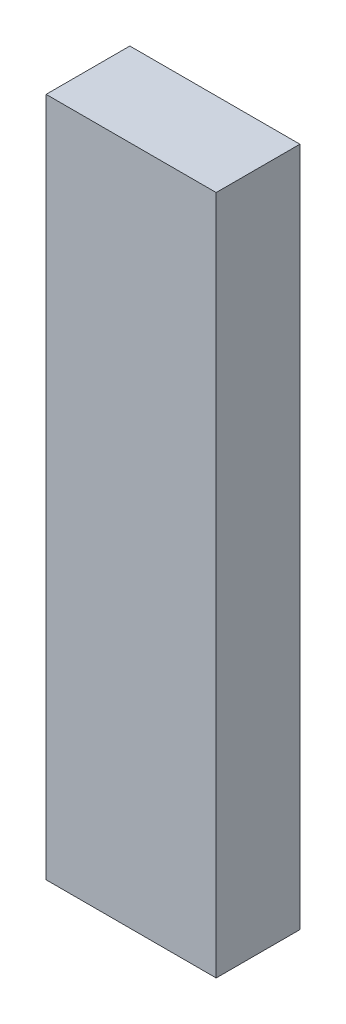
ISO-10303-21;
HEADER;
FILE_DESCRIPTION(('STEP AP214'),'2;1');
FILE_NAME('part.step','',(''),(''),'','','');
FILE_SCHEMA(('AUTOMOTIVE_DESIGN { 1 0 10303 214 1 1 1 1 }'));
ENDSEC;
DATA;
#1=APPLICATION_CONTEXT('core data for automotive mechanical design processes');
#2=APPLICATION_PROTOCOL_DEFINITION('international standard','automotive_design',2000,#1);
#3=PRODUCT_CONTEXT('',#1,'mechanical');
#4=PRODUCT('Part','Part','',(#3));
#5=PRODUCT_RELATED_PRODUCT_CATEGORY('part','',(#4));
#6=PRODUCT_DEFINITION_FORMATION('','',#4);
#7=PRODUCT_DEFINITION_CONTEXT('part definition',#1,'design');
#8=PRODUCT_DEFINITION('design','',#6,#7);
#9=PRODUCT_DEFINITION_SHAPE('','',#8);
#10=(LENGTH_UNIT() NAMED_UNIT(*) SI_UNIT(.MILLI.,.METRE.));
#11=(NAMED_UNIT(*) PLANE_ANGLE_UNIT() SI_UNIT($,.RADIAN.));
#12=(NAMED_UNIT(*) SI_UNIT($,.STERADIAN.) SOLID_ANGLE_UNIT());
#13=UNCERTAINTY_MEASURE_WITH_UNIT(LENGTH_MEASURE(1.E-05),#10,'distance_accuracy_value','');
#14=(GEOMETRIC_REPRESENTATION_CONTEXT(3) GLOBAL_UNCERTAINTY_ASSIGNED_CONTEXT((#13)) GLOBAL_UNIT_ASSIGNED_CONTEXT((#10,
#11,#12)) REPRESENTATION_CONTEXT('',''));
#15=CARTESIAN_POINT('',(0.,0.,0.));
#16=DIRECTION('',(0.,0.,1.));
#17=DIRECTION('',(1.,0.,0.));
#18=AXIS2_PLACEMENT_3D('',#15,#16,#17);
#19=CARTESIAN_POINT('',(-0.3250057,-3.71420136,0.31999936));
#20=DIRECTION('',(0.,0.,-1.));
#21=DIRECTION('',(-1.,0.,0.));
#22=AXIS2_PLACEMENT_3D('',#19,#20,#21);
#23=PLANE('',#22);
#24=DIRECTION('',(0.,1.,0.));
#25=VECTOR('',#24,1.);
#26=CARTESIAN_POINT('',(0.32499554,-6.31420124,0.31999936));
#27=LINE('',#26,#25);
#28=CARTESIAN_POINT('',(0.32499554,-6.31420124,0.31999936));
#29=VERTEX_POINT('',#28);
#30=CARTESIAN_POINT('',(0.32499554,-3.71420136,0.31999936));
#31=VERTEX_POINT('',#30);
#32=EDGE_CURVE('E79',#29,#31,#27,.T.);
#33=ORIENTED_EDGE('',*,*,#32,.T.);
#34=DIRECTION('',(1.,0.,0.));
#35=VECTOR('',#34,1.);
#36=CARTESIAN_POINT('',(0.32499554,-3.71420136,0.31999936));
#37=LINE('',#36,#35);
#38=CARTESIAN_POINT('',(-0.3250057,-3.71420136,0.31999936));
#39=VERTEX_POINT('',#38);
#40=EDGE_CURVE('E54',#31,#39,#37,.F.);
#41=ORIENTED_EDGE('',*,*,#40,.T.);
#42=DIRECTION('',(0.,1.,0.));
#43=VECTOR('',#42,1.);
#44=CARTESIAN_POINT('',(-0.3250057,-3.71420136,0.31999936));
#45=LINE('',#44,#43);
#46=CARTESIAN_POINT('',(-0.3250057,-6.31420124,0.31999936));
#47=VERTEX_POINT('',#46);
#48=EDGE_CURVE('E56',#39,#47,#45,.F.);
#49=ORIENTED_EDGE('',*,*,#48,.T.);
#50=DIRECTION('',(1.,0.,0.));
#51=VECTOR('',#50,1.);
#52=CARTESIAN_POINT('',(-0.3250057,-6.31420124,0.31999936));
#53=LINE('',#52,#51);
#54=EDGE_CURVE('E19',#47,#29,#53,.T.);
#55=ORIENTED_EDGE('',*,*,#54,.T.);
#56=EDGE_LOOP('',(#33,#41,#49,#55));
#57=FACE_BOUND('',#56,.T.);
#58=ADVANCED_FACE('F16',(#57),#23,.F.);
#59=CARTESIAN_POINT('',(-0.3250057,-6.31420124,0.));
#60=DIRECTION('',(0.,1.,0.));
#61=DIRECTION('',(0.,0.,1.));
#62=AXIS2_PLACEMENT_3D('',#59,#60,#61);
#63=PLANE('',#62);
#64=ORIENTED_EDGE('',*,*,#54,.F.);
#65=DIRECTION('',(0.,0.,-1.));
#66=VECTOR('',#65,1.);
#67=CARTESIAN_POINT('',(-0.3250057,-6.31420124,0.));
#68=LINE('',#67,#66);
#69=CARTESIAN_POINT('',(-0.3250057,-6.31420124,0.));
#70=VERTEX_POINT('',#69);
#71=EDGE_CURVE('E62',#47,#70,#68,.T.);
#72=ORIENTED_EDGE('',*,*,#71,.T.);
#73=DIRECTION('',(-1.,0.,0.));
#74=VECTOR('',#73,1.);
#75=CARTESIAN_POINT('',(-0.3250057,-6.31420124,0.));
#76=LINE('',#75,#74);
#77=CARTESIAN_POINT('',(0.32499554,-6.31420124,0.));
#78=VERTEX_POINT('',#77);
#79=EDGE_CURVE('E82',#78,#70,#76,.T.);
#80=ORIENTED_EDGE('',*,*,#79,.F.);
#81=DIRECTION('',(0.,0.,1.));
#82=VECTOR('',#81,1.);
#83=CARTESIAN_POINT('',(0.32499554,-6.31420124,0.));
#84=LINE('',#83,#82);
#85=EDGE_CURVE('E67',#78,#29,#84,.T.);
#86=ORIENTED_EDGE('',*,*,#85,.T.);
#87=EDGE_LOOP('',(#64,#72,#80,#86));
#88=FACE_BOUND('',#87,.T.);
#89=ADVANCED_FACE('F64',(#88),#63,.F.);
#90=CARTESIAN_POINT('',(-0.3250057,-3.71420136,0.));
#91=DIRECTION('',(1.,0.,0.));
#92=DIRECTION('',(0.,0.,-1.));
#93=AXIS2_PLACEMENT_3D('',#90,#91,#92);
#94=PLANE('',#93);
#95=ORIENTED_EDGE('',*,*,#48,.F.);
#96=DIRECTION('',(0.,0.,-1.));
#97=VECTOR('',#96,1.);
#98=CARTESIAN_POINT('',(-0.3250057,-3.71420136,0.));
#99=LINE('',#98,#97);
#100=CARTESIAN_POINT('',(-0.3250057,-3.71420136,0.));
#101=VERTEX_POINT('',#100);
#102=EDGE_CURVE('E74',#39,#101,#99,.T.);
#103=ORIENTED_EDGE('',*,*,#102,.T.);
#104=DIRECTION('',(0.,1.,0.));
#105=VECTOR('',#104,1.);
#106=CARTESIAN_POINT('',(-0.3250057,-3.71420136,0.));
#107=LINE('',#106,#105);
#108=EDGE_CURVE('E71',#70,#101,#107,.T.);
#109=ORIENTED_EDGE('',*,*,#108,.F.);
#110=ORIENTED_EDGE('',*,*,#71,.F.);
#111=EDGE_LOOP('',(#95,#103,#109,#110));
#112=FACE_BOUND('',#111,.T.);
#113=ADVANCED_FACE('F69',(#112),#94,.F.);
#114=CARTESIAN_POINT('',(0.32499554,-3.71420136,0.));
#115=DIRECTION('',(0.,-1.,0.));
#116=DIRECTION('',(0.,0.,-1.));
#117=AXIS2_PLACEMENT_3D('',#114,#115,#116);
#118=PLANE('',#117);
#119=ORIENTED_EDGE('',*,*,#40,.F.);
#120=DIRECTION('',(0.,0.,1.));
#121=VECTOR('',#120,1.);
#122=CARTESIAN_POINT('',(0.32499554,-3.71420136,0.));
#123=LINE('',#122,#121);
#124=CARTESIAN_POINT('',(0.32499554,-3.71420136,0.));
#125=VERTEX_POINT('',#124);
#126=EDGE_CURVE('E34',#31,#125,#123,.F.);
#127=ORIENTED_EDGE('',*,*,#126,.T.);
#128=DIRECTION('',(-1.,0.,0.));
#129=VECTOR('',#128,1.);
#130=CARTESIAN_POINT('',(-0.3250057,-3.71420136,0.));
#131=LINE('',#130,#129);
#132=EDGE_CURVE('E25',#101,#125,#131,.F.);
#133=ORIENTED_EDGE('',*,*,#132,.F.);
#134=ORIENTED_EDGE('',*,*,#102,.F.);
#135=EDGE_LOOP('',(#119,#127,#133,#134));
#136=FACE_BOUND('',#135,.T.);
#137=ADVANCED_FACE('F88',(#136),#118,.F.);
#138=CARTESIAN_POINT('',(0.32499554,-6.31420124,0.));
#139=DIRECTION('',(-1.,0.,0.));
#140=DIRECTION('',(0.,0.,1.));
#141=AXIS2_PLACEMENT_3D('',#138,#139,#140);
#142=PLANE('',#141);
#143=ORIENTED_EDGE('',*,*,#32,.F.);
#144=ORIENTED_EDGE('',*,*,#85,.F.);
#145=DIRECTION('',(0.,1.,0.));
#146=VECTOR('',#145,1.);
#147=CARTESIAN_POINT('',(0.32499554,-3.71420136,0.));
#148=LINE('',#147,#146);
#149=EDGE_CURVE('E11',#125,#78,#148,.F.);
#150=ORIENTED_EDGE('',*,*,#149,.F.);
#151=ORIENTED_EDGE('',*,*,#126,.F.);
#152=EDGE_LOOP('',(#143,#144,#150,#151));
#153=FACE_BOUND('',#152,.T.);
#154=ADVANCED_FACE('F90',(#153),#142,.F.);
#155=CARTESIAN_POINT('',(-0.3250057,-3.71420136,0.));
#156=DIRECTION('',(0.,0.,-1.));
#157=DIRECTION('',(-1.,0.,0.));
#158=AXIS2_PLACEMENT_3D('',#155,#156,#157);
#159=PLANE('',#158);
#160=ORIENTED_EDGE('',*,*,#132,.T.);
#161=ORIENTED_EDGE('',*,*,#149,.T.);
#162=ORIENTED_EDGE('',*,*,#79,.T.);
#163=ORIENTED_EDGE('',*,*,#108,.T.);
#164=EDGE_LOOP('',(#160,#161,#162,#163));
#165=FACE_BOUND('',#164,.T.);
#166=ADVANCED_FACE('F87',(#165),#159,.T.);
#167=CLOSED_SHELL('',(#58,#89,#113,#137,#154,#166));
#168=MANIFOLD_SOLID_BREP('B1',#167);
#169=ADVANCED_BREP_SHAPE_REPRESENTATION('',(#18,#168),#14);
#170=SHAPE_DEFINITION_REPRESENTATION(#9,#169);
ENDSEC;
END-ISO-10303-21;
